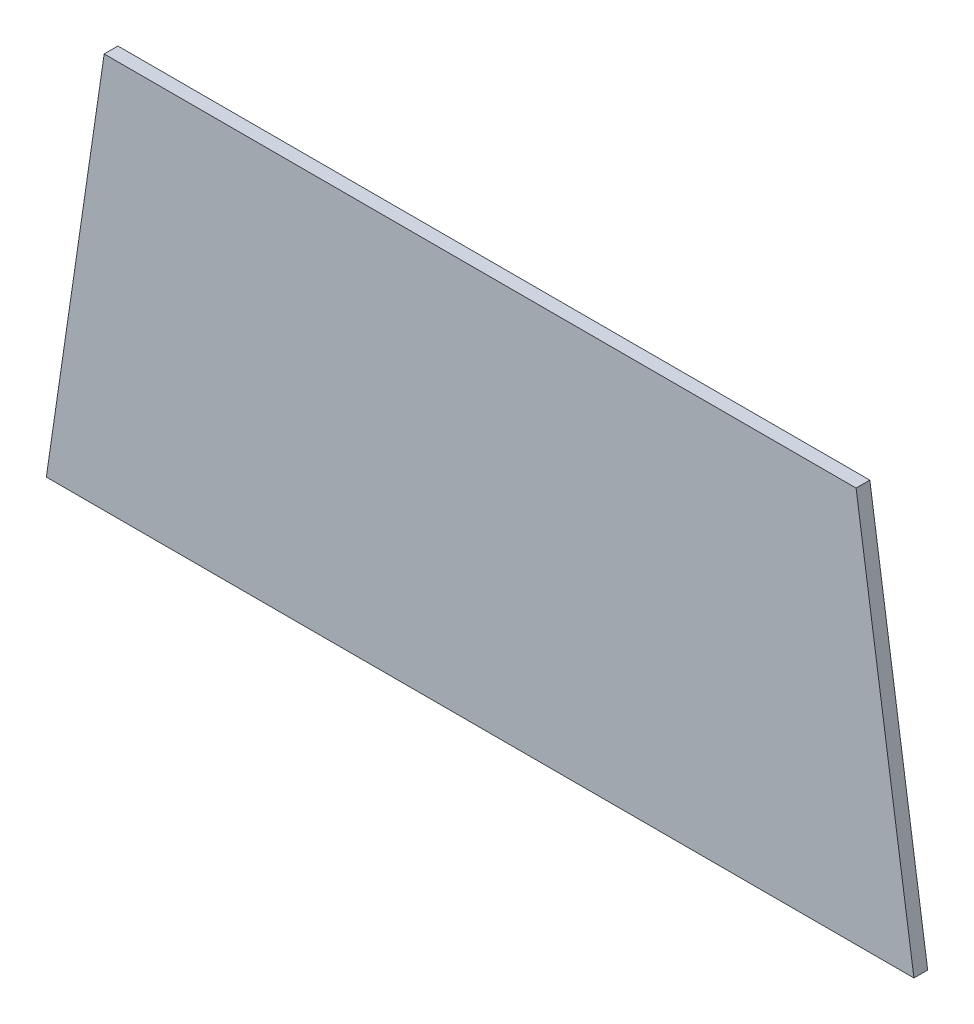
ISO-10303-21;
HEADER;
FILE_DESCRIPTION(('STEP AP214'),'2;1');
FILE_NAME('part.step','',(''),(''),'','','');
FILE_SCHEMA(('AUTOMOTIVE_DESIGN { 1 0 10303 214 1 1 1 1 }'));
ENDSEC;
DATA;
#1=APPLICATION_CONTEXT('core data for automotive mechanical design processes');
#2=APPLICATION_PROTOCOL_DEFINITION('international standard','automotive_design',2000,#1);
#3=PRODUCT_CONTEXT('',#1,'mechanical');
#4=PRODUCT('Part','Part','',(#3));
#5=PRODUCT_RELATED_PRODUCT_CATEGORY('part','',(#4));
#6=PRODUCT_DEFINITION_FORMATION('','',#4);
#7=PRODUCT_DEFINITION_CONTEXT('part definition',#1,'design');
#8=PRODUCT_DEFINITION('design','',#6,#7);
#9=PRODUCT_DEFINITION_SHAPE('','',#8);
#10=(LENGTH_UNIT() NAMED_UNIT(*) SI_UNIT(.MILLI.,.METRE.));
#11=(NAMED_UNIT(*) PLANE_ANGLE_UNIT() SI_UNIT($,.RADIAN.));
#12=(NAMED_UNIT(*) SI_UNIT($,.STERADIAN.) SOLID_ANGLE_UNIT());
#13=UNCERTAINTY_MEASURE_WITH_UNIT(LENGTH_MEASURE(1.E-05),#10,'distance_accuracy_value','');
#14=(GEOMETRIC_REPRESENTATION_CONTEXT(3) GLOBAL_UNCERTAINTY_ASSIGNED_CONTEXT((#13)) GLOBAL_UNIT_ASSIGNED_CONTEXT((#10,
#11,#12)) REPRESENTATION_CONTEXT('',''));
#15=CARTESIAN_POINT('',(0.,0.,0.));
#16=DIRECTION('',(0.,0.,1.));
#17=DIRECTION('',(1.,0.,0.));
#18=AXIS2_PLACEMENT_3D('',#15,#16,#17);
#19=CARTESIAN_POINT('',(0.,0.,0.8));
#20=DIRECTION('',(0.,1.,0.));
#21=DIRECTION('',(0.,0.,1.));
#22=AXIS2_PLACEMENT_3D('',#19,#20,#21);
#23=PLANE('',#22);
#24=DIRECTION('',(1.,0.,0.));
#25=VECTOR('',#24,1.);
#26=CARTESIAN_POINT('',(0.,0.,0.));
#27=LINE('',#26,#25);
#28=CARTESIAN_POINT('',(0.,0.,0.));
#29=VERTEX_POINT('',#28);
#30=CARTESIAN_POINT('',(50.47,0.,0.));
#31=VERTEX_POINT('',#30);
#32=EDGE_CURVE('E96',#29,#31,#27,.T.);
#33=ORIENTED_EDGE('',*,*,#32,.T.);
#34=DIRECTION('',(0.,0.,-1.));
#35=VECTOR('',#34,1.);
#36=CARTESIAN_POINT('',(50.47,0.,0.8));
#37=LINE('',#36,#35);
#38=CARTESIAN_POINT('',(50.47,0.,0.8));
#39=VERTEX_POINT('',#38);
#40=EDGE_CURVE('E11',#39,#31,#37,.T.);
#41=ORIENTED_EDGE('',*,*,#40,.F.);
#42=DIRECTION('',(1.,0.,0.));
#43=VECTOR('',#42,1.);
#44=CARTESIAN_POINT('',(0.,0.,0.8));
#45=LINE('',#44,#43);
#46=CARTESIAN_POINT('',(0.,0.,0.8));
#47=VERTEX_POINT('',#46);
#48=EDGE_CURVE('E84',#47,#39,#45,.T.);
#49=ORIENTED_EDGE('',*,*,#48,.F.);
#50=DIRECTION('',(0.,0.,-1.));
#51=VECTOR('',#50,1.);
#52=CARTESIAN_POINT('',(0.,0.,0.8));
#53=LINE('',#52,#51);
#54=EDGE_CURVE('E92',#47,#29,#53,.T.);
#55=ORIENTED_EDGE('',*,*,#54,.T.);
#56=EDGE_LOOP('',(#33,#41,#49,#55));
#57=FACE_BOUND('',#56,.T.);
#58=ADVANCED_FACE('F33',(#57),#23,.F.);
#59=CARTESIAN_POINT('',(50.47,0.,0.8));
#60=DIRECTION('',(-0.989466325133588,-0.144763225394545,0.));
#61=DIRECTION('',(0.144763225394545,-0.989466325133589,0.));
#62=AXIS2_PLACEMENT_3D('',#59,#60,#61);
#63=PLANE('',#62);
#64=DIRECTION('',(-0.144763225394545,0.989466325133589,0.));
#65=VECTOR('',#64,1.);
#66=CARTESIAN_POINT('',(50.47,0.,0.));
#67=LINE('',#66,#65);
#68=CARTESIAN_POINT('',(47.105,23.,0.));
#69=VERTEX_POINT('',#68);
#70=EDGE_CURVE('E88',#31,#69,#67,.T.);
#71=ORIENTED_EDGE('',*,*,#70,.T.);
#72=DIRECTION('',(0.,0.,-1.));
#73=VECTOR('',#72,1.);
#74=CARTESIAN_POINT('',(47.105,23.,0.8));
#75=LINE('',#74,#73);
#76=CARTESIAN_POINT('',(47.105,23.,0.8));
#77=VERTEX_POINT('',#76);
#78=EDGE_CURVE('E41',#77,#69,#75,.T.);
#79=ORIENTED_EDGE('',*,*,#78,.F.);
#80=DIRECTION('',(-0.144763225394545,0.989466325133589,0.));
#81=VECTOR('',#80,1.);
#82=CARTESIAN_POINT('',(50.47,0.,0.8));
#83=LINE('',#82,#81);
#84=EDGE_CURVE('E79',#39,#77,#83,.T.);
#85=ORIENTED_EDGE('',*,*,#84,.F.);
#86=ORIENTED_EDGE('',*,*,#40,.T.);
#87=EDGE_LOOP('',(#71,#79,#85,#86));
#88=FACE_BOUND('',#87,.T.);
#89=ADVANCED_FACE('F87',(#88),#63,.F.);
#90=CARTESIAN_POINT('',(3.36499999999999,23.,0.8));
#91=DIRECTION('',(0.,-1.,0.));
#92=DIRECTION('',(0.,0.,-1.));
#93=AXIS2_PLACEMENT_3D('',#90,#91,#92);
#94=PLANE('',#93);
#95=DIRECTION('',(-1.,0.,0.));
#96=VECTOR('',#95,1.);
#97=CARTESIAN_POINT('',(3.36499999999999,23.,0.));
#98=LINE('',#97,#96);
#99=CARTESIAN_POINT('',(3.36499999999999,23.,0.));
#100=VERTEX_POINT('',#99);
#101=EDGE_CURVE('E66',#69,#100,#98,.T.);
#102=ORIENTED_EDGE('',*,*,#101,.T.);
#103=DIRECTION('',(0.,0.,-1.));
#104=VECTOR('',#103,1.);
#105=CARTESIAN_POINT('',(3.36499999999999,23.,0.8));
#106=LINE('',#105,#104);
#107=CARTESIAN_POINT('',(3.36499999999999,23.,0.8));
#108=VERTEX_POINT('',#107);
#109=EDGE_CURVE('E89',#108,#100,#106,.T.);
#110=ORIENTED_EDGE('',*,*,#109,.F.);
#111=DIRECTION('',(-1.,0.,0.));
#112=VECTOR('',#111,1.);
#113=CARTESIAN_POINT('',(3.36499999999999,23.,0.8));
#114=LINE('',#113,#112);
#115=EDGE_CURVE('E82',#77,#108,#114,.T.);
#116=ORIENTED_EDGE('',*,*,#115,.F.);
#117=ORIENTED_EDGE('',*,*,#78,.T.);
#118=EDGE_LOOP('',(#102,#110,#116,#117));
#119=FACE_BOUND('',#118,.T.);
#120=ADVANCED_FACE('F90',(#119),#94,.F.);
#121=CARTESIAN_POINT('',(0.,0.,0.8));
#122=DIRECTION('',(0.989466325133589,-0.144763225394544,0.));
#123=DIRECTION('',(0.144763225394544,0.989466325133589,0.));
#124=AXIS2_PLACEMENT_3D('',#121,#122,#123);
#125=PLANE('',#124);
#126=DIRECTION('',(-0.144763225394544,-0.989466325133589,0.));
#127=VECTOR('',#126,1.);
#128=CARTESIAN_POINT('',(0.,0.,0.));
#129=LINE('',#128,#127);
#130=EDGE_CURVE('E72',#100,#29,#129,.T.);
#131=ORIENTED_EDGE('',*,*,#130,.T.);
#132=ORIENTED_EDGE('',*,*,#54,.F.);
#133=DIRECTION('',(-0.144763225394544,-0.989466325133589,0.));
#134=VECTOR('',#133,1.);
#135=CARTESIAN_POINT('',(0.,0.,0.8));
#136=LINE('',#135,#134);
#137=EDGE_CURVE('E49',#108,#47,#136,.T.);
#138=ORIENTED_EDGE('',*,*,#137,.F.);
#139=ORIENTED_EDGE('',*,*,#109,.T.);
#140=EDGE_LOOP('',(#131,#132,#138,#139));
#141=FACE_BOUND('',#140,.T.);
#142=ADVANCED_FACE('F103',(#141),#125,.F.);
#143=CARTESIAN_POINT('',(0.,0.,0.8));
#144=DIRECTION('',(0.,0.,1.));
#145=DIRECTION('',(1.,0.,0.));
#146=AXIS2_PLACEMENT_3D('',#143,#144,#145);
#147=PLANE('',#146);
#148=ORIENTED_EDGE('',*,*,#48,.T.);
#149=ORIENTED_EDGE('',*,*,#84,.T.);
#150=ORIENTED_EDGE('',*,*,#115,.T.);
#151=ORIENTED_EDGE('',*,*,#137,.T.);
#152=EDGE_LOOP('',(#148,#149,#150,#151));
#153=FACE_BOUND('',#152,.T.);
#154=ADVANCED_FACE('F80',(#153),#147,.T.);
#155=CARTESIAN_POINT('',(0.,0.,0.));
#156=DIRECTION('',(0.,0.,1.));
#157=DIRECTION('',(1.,0.,0.));
#158=AXIS2_PLACEMENT_3D('',#155,#156,#157);
#159=PLANE('',#158);
#160=ORIENTED_EDGE('',*,*,#32,.F.);
#161=ORIENTED_EDGE('',*,*,#130,.F.);
#162=ORIENTED_EDGE('',*,*,#101,.F.);
#163=ORIENTED_EDGE('',*,*,#70,.F.);
#164=EDGE_LOOP('',(#160,#161,#162,#163));
#165=FACE_BOUND('',#164,.T.);
#166=ADVANCED_FACE('F106',(#165),#159,.F.);
#167=CLOSED_SHELL('',(#58,#89,#120,#142,#154,#166));
#168=MANIFOLD_SOLID_BREP('B2',#167);
#169=ADVANCED_BREP_SHAPE_REPRESENTATION('',(#18,#168),#14);
#170=SHAPE_DEFINITION_REPRESENTATION(#9,#169);
ENDSEC;
END-ISO-10303-21;
